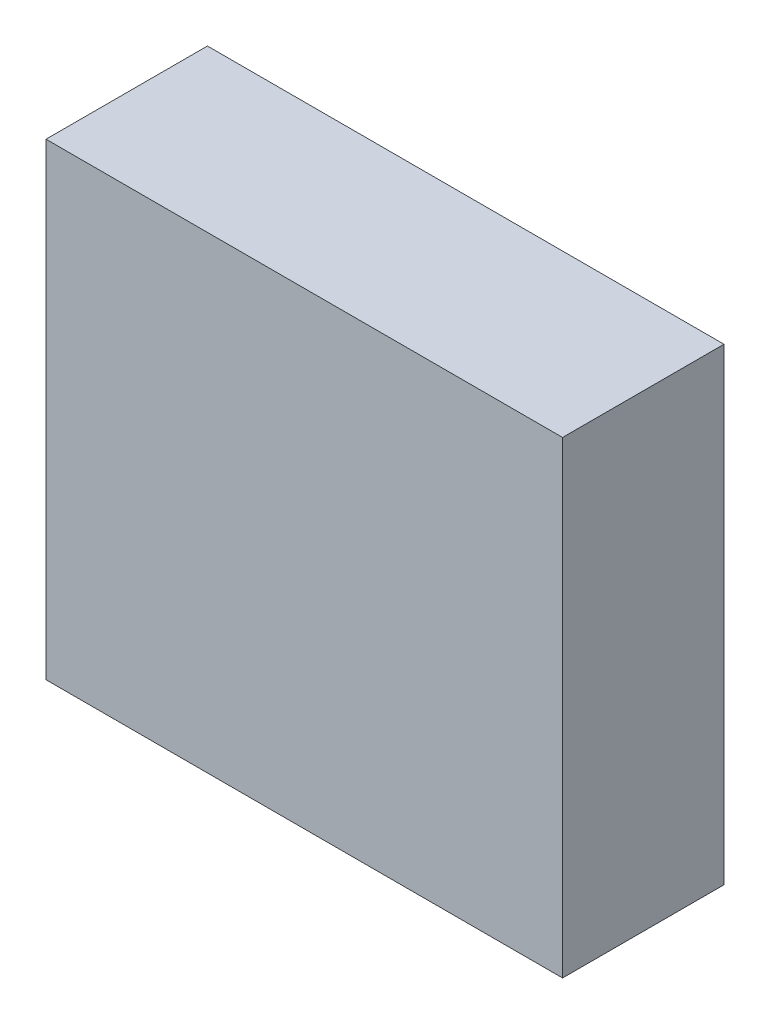
ISO-10303-21;
HEADER;
FILE_DESCRIPTION(('STEP AP214'),'2;1');
FILE_NAME('part.step','',(''),(''),'','','');
FILE_SCHEMA(('AUTOMOTIVE_DESIGN { 1 0 10303 214 1 1 1 1 }'));
ENDSEC;
DATA;
#1=APPLICATION_CONTEXT('core data for automotive mechanical design processes');
#2=APPLICATION_PROTOCOL_DEFINITION('international standard','automotive_design',2000,#1);
#3=PRODUCT_CONTEXT('',#1,'mechanical');
#4=PRODUCT('Part','Part','',(#3));
#5=PRODUCT_RELATED_PRODUCT_CATEGORY('part','',(#4));
#6=PRODUCT_DEFINITION_FORMATION('','',#4);
#7=PRODUCT_DEFINITION_CONTEXT('part definition',#1,'design');
#8=PRODUCT_DEFINITION('design','',#6,#7);
#9=PRODUCT_DEFINITION_SHAPE('','',#8);
#10=(LENGTH_UNIT() NAMED_UNIT(*) SI_UNIT(.MILLI.,.METRE.));
#11=(NAMED_UNIT(*) PLANE_ANGLE_UNIT() SI_UNIT($,.RADIAN.));
#12=(NAMED_UNIT(*) SI_UNIT($,.STERADIAN.) SOLID_ANGLE_UNIT());
#13=UNCERTAINTY_MEASURE_WITH_UNIT(LENGTH_MEASURE(1.E-05),#10,'distance_accuracy_value','');
#14=(GEOMETRIC_REPRESENTATION_CONTEXT(3) GLOBAL_UNCERTAINTY_ASSIGNED_CONTEXT((#13)) GLOBAL_UNIT_ASSIGNED_CONTEXT((#10,
#11,#12)) REPRESENTATION_CONTEXT('',''));
#15=CARTESIAN_POINT('',(0.,0.,0.));
#16=DIRECTION('',(0.,0.,1.));
#17=DIRECTION('',(1.,0.,0.));
#18=AXIS2_PLACEMENT_3D('',#15,#16,#17);
#19=CARTESIAN_POINT('',(-0.799971165156933,-0.724995211408185,-2.64111989736557));
#20=DIRECTION('',(-1.74845553146952E-07,-1.,0.));
#21=DIRECTION('',(1.,-1.74845553146952E-07,0.));
#22=AXIS2_PLACEMENT_3D('',#19,#20,#21);
#23=PLANE('',#22);
#24=DIRECTION('',(0.999999999999985,-1.74845553170802E-07,0.));
#25=VECTOR('',#24,1.);
#26=CARTESIAN_POINT('',(-0.799971165156933,-0.724995211408185,-2.64111989736557));
#27=LINE('',#26,#25);
#28=CARTESIAN_POINT('',(-0.799971165156933,-0.724995211408185,-2.64111989736557));
#29=VERTEX_POINT('',#28);
#30=CARTESIAN_POINT('',(0.800004420780567,-0.724995491156804,-2.64111989736557));
#31=VERTEX_POINT('',#30);
#32=EDGE_CURVE('E11',#29,#31,#27,.T.);
#33=ORIENTED_EDGE('',*,*,#32,.T.);
#34=DIRECTION('',(0.,0.,1.));
#35=VECTOR('',#34,1.);
#36=CARTESIAN_POINT('',(0.800004420780567,-0.724995491156801,-2.64111989736557));
#37=LINE('',#36,#35);
#38=CARTESIAN_POINT('',(0.800004420780567,-0.724995491156804,-2.14112091064453));
#39=VERTEX_POINT('',#38);
#40=EDGE_CURVE('E88',#31,#39,#37,.T.);
#41=ORIENTED_EDGE('',*,*,#40,.T.);
#42=DIRECTION('',(0.999999999999985,-1.74845553170802E-07,0.));
#43=VECTOR('',#42,1.);
#44=CARTESIAN_POINT('',(-0.799971165156933,-0.724995211408185,-2.14112091064453));
#45=LINE('',#44,#43);
#46=CARTESIAN_POINT('',(-0.799971165156933,-0.724995211408185,-2.14112091064453));
#47=VERTEX_POINT('',#46);
#48=EDGE_CURVE('E83',#47,#39,#45,.T.);
#49=ORIENTED_EDGE('',*,*,#48,.F.);
#50=DIRECTION('',(0.,0.,1.));
#51=VECTOR('',#50,1.);
#52=CARTESIAN_POINT('',(-0.799971165156907,-0.724995211408185,-2.64111989736557));
#53=LINE('',#52,#51);
#54=EDGE_CURVE('E72',#29,#47,#53,.T.);
#55=ORIENTED_EDGE('',*,*,#54,.F.);
#56=EDGE_LOOP('',(#33,#41,#49,#55));
#57=FACE_BOUND('',#56,.T.);
#58=ADVANCED_FACE('F17',(#57),#23,.T.);
#59=CARTESIAN_POINT('',(0.800004420780567,-0.724995491156804,-2.64111989736557));
#60=DIRECTION('',(1.,-1.74845553146952E-07,0.));
#61=DIRECTION('',(1.74845553146952E-07,1.,0.));
#62=AXIS2_PLACEMENT_3D('',#59,#60,#61);
#63=PLANE('',#62);
#64=DIRECTION('',(1.74845553118087E-07,0.999999999999985,0.));
#65=VECTOR('',#64,1.);
#66=CARTESIAN_POINT('',(0.800004420780567,-0.724995491156804,-2.64111989736557));
#67=LINE('',#66,#65);
#68=CARTESIAN_POINT('',(0.800004674307445,0.725009086479915,-2.64111989736557));
#69=VERTEX_POINT('',#68);
#70=EDGE_CURVE('E24',#31,#69,#67,.T.);
#71=ORIENTED_EDGE('',*,*,#70,.T.);
#72=DIRECTION('',(0.,0.,1.));
#73=VECTOR('',#72,1.);
#74=CARTESIAN_POINT('',(0.80000467430742,0.725009086479915,-2.64111989736557));
#75=LINE('',#74,#73);
#76=CARTESIAN_POINT('',(0.800004674307445,0.725009086479915,-2.14112091064453));
#77=VERTEX_POINT('',#76);
#78=EDGE_CURVE('E85',#69,#77,#75,.T.);
#79=ORIENTED_EDGE('',*,*,#78,.T.);
#80=DIRECTION('',(1.74845553118087E-07,0.999999999999985,0.));
#81=VECTOR('',#80,1.);
#82=CARTESIAN_POINT('',(0.800004420780567,-0.724995491156804,-2.14112091064453));
#83=LINE('',#82,#81);
#84=EDGE_CURVE('E66',#39,#77,#83,.T.);
#85=ORIENTED_EDGE('',*,*,#84,.F.);
#86=ORIENTED_EDGE('',*,*,#40,.F.);
#87=EDGE_LOOP('',(#71,#79,#85,#86));
#88=FACE_BOUND('',#87,.T.);
#89=ADVANCED_FACE('F89',(#88),#63,.T.);
#90=CARTESIAN_POINT('',(0.800004674307445,0.725009086479915,-2.64111989736557));
#91=DIRECTION('',(1.74845553146952E-07,1.,0.));
#92=DIRECTION('',(-1.,1.74845553146952E-07,0.));
#93=AXIS2_PLACEMENT_3D('',#90,#91,#92);
#94=PLANE('',#93);
#95=DIRECTION('',(-0.999999999999985,1.74845553170802E-07,0.));
#96=VECTOR('',#95,1.);
#97=CARTESIAN_POINT('',(0.800004674307445,0.725009086479915,-2.64111989736557));
#98=LINE('',#97,#96);
#99=CARTESIAN_POINT('',(-0.799970911630055,0.725009366228534,-2.64111989736557));
#100=VERTEX_POINT('',#99);
#101=EDGE_CURVE('E62',#69,#100,#98,.T.);
#102=ORIENTED_EDGE('',*,*,#101,.T.);
#103=DIRECTION('',(0.,0.,1.));
#104=VECTOR('',#103,1.);
#105=CARTESIAN_POINT('',(-0.799970911630055,0.725009366228531,-2.64111989736557));
#106=LINE('',#105,#104);
#107=CARTESIAN_POINT('',(-0.799970911630055,0.725009366228534,-2.14112091064453));
#108=VERTEX_POINT('',#107);
#109=EDGE_CURVE('E55',#100,#108,#106,.T.);
#110=ORIENTED_EDGE('',*,*,#109,.T.);
#111=DIRECTION('',(-0.999999999999985,1.74845553170802E-07,0.));
#112=VECTOR('',#111,1.);
#113=CARTESIAN_POINT('',(0.800004674307445,0.725009086479915,-2.14112091064453));
#114=LINE('',#113,#112);
#115=EDGE_CURVE('E59',#77,#108,#114,.T.);
#116=ORIENTED_EDGE('',*,*,#115,.F.);
#117=ORIENTED_EDGE('',*,*,#78,.F.);
#118=EDGE_LOOP('',(#102,#110,#116,#117));
#119=FACE_BOUND('',#118,.T.);
#120=ADVANCED_FACE('F57',(#119),#94,.T.);
#121=CARTESIAN_POINT('',(-0.799970911630055,0.725009366228534,-2.64111989736557));
#122=DIRECTION('',(-1.,1.74845553146952E-07,0.));
#123=DIRECTION('',(-1.74845553146952E-07,-1.,0.));
#124=AXIS2_PLACEMENT_3D('',#121,#122,#123);
#125=PLANE('',#124);
#126=DIRECTION('',(-1.74845553118087E-07,-0.999999999999985,0.));
#127=VECTOR('',#126,1.);
#128=CARTESIAN_POINT('',(-0.799970911630055,0.725009366228534,-2.64111989736557));
#129=LINE('',#128,#127);
#130=EDGE_CURVE('E65',#100,#29,#129,.T.);
#131=ORIENTED_EDGE('',*,*,#130,.T.);
#132=ORIENTED_EDGE('',*,*,#54,.T.);
#133=DIRECTION('',(-1.74845553118087E-07,-0.999999999999985,0.));
#134=VECTOR('',#133,1.);
#135=CARTESIAN_POINT('',(-0.799970911630055,0.725009366228534,-2.14112091064453));
#136=LINE('',#135,#134);
#137=EDGE_CURVE('E70',#108,#47,#136,.T.);
#138=ORIENTED_EDGE('',*,*,#137,.F.);
#139=ORIENTED_EDGE('',*,*,#109,.F.);
#140=EDGE_LOOP('',(#131,#132,#138,#139));
#141=FACE_BOUND('',#140,.T.);
#142=ADVANCED_FACE('F71',(#141),#125,.T.);
#143=CARTESIAN_POINT('',(-462.125,-95.8249130249023,-2.14112091064453));
#144=DIRECTION('',(0.,0.,1.));
#145=DIRECTION('',(1.,-1.74845553146952E-07,0.));
#146=AXIS2_PLACEMENT_3D('',#143,#144,#145);
#147=PLANE('',#146);
#148=ORIENTED_EDGE('',*,*,#48,.T.);
#149=ORIENTED_EDGE('',*,*,#84,.T.);
#150=ORIENTED_EDGE('',*,*,#115,.T.);
#151=ORIENTED_EDGE('',*,*,#137,.T.);
#152=EDGE_LOOP('',(#148,#149,#150,#151));
#153=FACE_BOUND('',#152,.T.);
#154=ADVANCED_FACE('F76',(#153),#147,.T.);
#155=CARTESIAN_POINT('',(-462.125,-95.8249130249023,-2.64111989736557));
#156=DIRECTION('',(0.,0.,1.));
#157=DIRECTION('',(1.,-1.74845553146952E-07,0.));
#158=AXIS2_PLACEMENT_3D('',#155,#156,#157);
#159=PLANE('',#158);
#160=ORIENTED_EDGE('',*,*,#130,.F.);
#161=ORIENTED_EDGE('',*,*,#101,.F.);
#162=ORIENTED_EDGE('',*,*,#70,.F.);
#163=ORIENTED_EDGE('',*,*,#32,.F.);
#164=EDGE_LOOP('',(#160,#161,#162,#163));
#165=FACE_BOUND('',#164,.T.);
#166=ADVANCED_FACE('F91',(#165),#159,.F.);
#167=CLOSED_SHELL('',(#58,#89,#120,#142,#154,#166));
#168=MANIFOLD_SOLID_BREP('B1',#167);
#169=ADVANCED_BREP_SHAPE_REPRESENTATION('',(#18,#168),#14);
#170=SHAPE_DEFINITION_REPRESENTATION(#9,#169);
ENDSEC;
END-ISO-10303-21;
